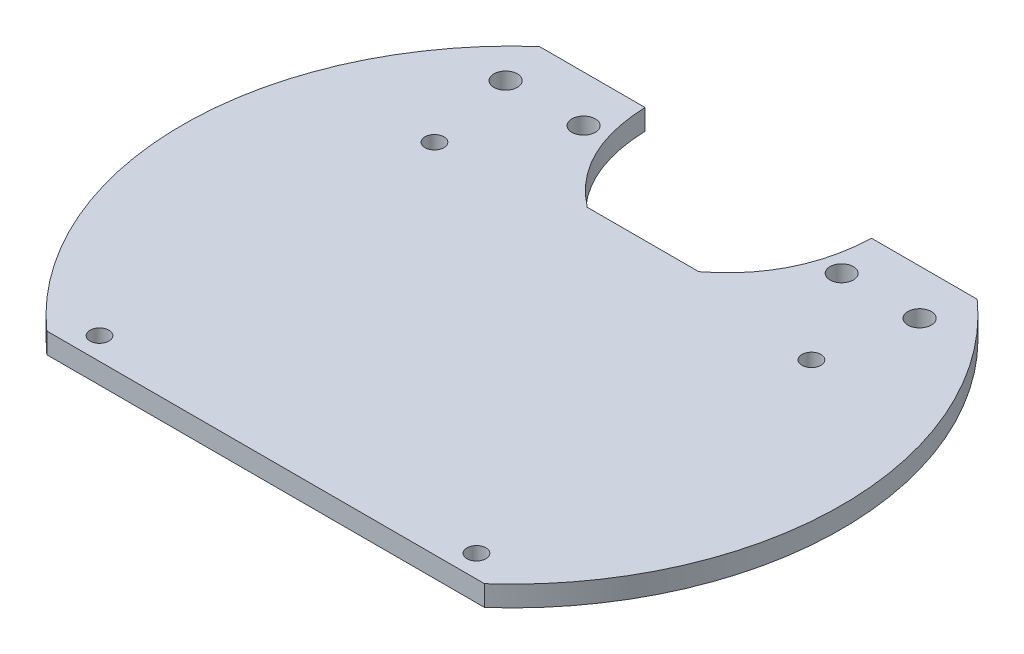
ISO-10303-21;
HEADER;
FILE_DESCRIPTION(('STEP AP214'),'2;1');
FILE_NAME('part.step','',(''),(''),'','','');
FILE_SCHEMA(('AUTOMOTIVE_DESIGN { 1 0 10303 214 1 1 1 1 }'));
ENDSEC;
DATA;
#1=APPLICATION_CONTEXT('core data for automotive mechanical design processes');
#2=APPLICATION_PROTOCOL_DEFINITION('international standard','automotive_design',2000,#1);
#3=PRODUCT_CONTEXT('',#1,'mechanical');
#4=PRODUCT('Part','Part','',(#3));
#5=PRODUCT_RELATED_PRODUCT_CATEGORY('part','',(#4));
#6=PRODUCT_DEFINITION_FORMATION('','',#4);
#7=PRODUCT_DEFINITION_CONTEXT('part definition',#1,'design');
#8=PRODUCT_DEFINITION('design','',#6,#7);
#9=PRODUCT_DEFINITION_SHAPE('','',#8);
#10=(LENGTH_UNIT() NAMED_UNIT(*) SI_UNIT(.MILLI.,.METRE.));
#11=(NAMED_UNIT(*) PLANE_ANGLE_UNIT() SI_UNIT($,.RADIAN.));
#12=(NAMED_UNIT(*) SI_UNIT($,.STERADIAN.) SOLID_ANGLE_UNIT());
#13=UNCERTAINTY_MEASURE_WITH_UNIT(LENGTH_MEASURE(1.E-05),#10,'distance_accuracy_value','');
#14=(GEOMETRIC_REPRESENTATION_CONTEXT(3) GLOBAL_UNCERTAINTY_ASSIGNED_CONTEXT((#13)) GLOBAL_UNIT_ASSIGNED_CONTEXT((#10,
#11,#12)) REPRESENTATION_CONTEXT('',''));
#15=CARTESIAN_POINT('',(0.,0.,0.));
#16=DIRECTION('',(0.,0.,1.));
#17=DIRECTION('',(1.,0.,0.));
#18=AXIS2_PLACEMENT_3D('',#15,#16,#17);
#19=CARTESIAN_POINT('',(0.,3.175,0.));
#20=DIRECTION('',(0.,-1.,0.));
#21=DIRECTION('',(0.,0.,-1.));
#22=AXIS2_PLACEMENT_3D('',#19,#20,#21);
#23=CYLINDRICAL_SURFACE('',#22,50.8);
#24=CARTESIAN_POINT('',(0.,3.175,0.));
#25=DIRECTION('',(0.,1.,0.));
#26=DIRECTION('',(0.,0.,1.));
#27=AXIS2_PLACEMENT_3D('',#24,#25,#26);
#28=CIRCLE('',#27,50.8);
#29=CARTESIAN_POINT('',(33.7387824248831,3.175,37.97808));
#30=VERTEX_POINT('',#29);
#31=CARTESIAN_POINT('',(33.7387824248831,3.175,-37.97808));
#32=VERTEX_POINT('',#31);
#33=EDGE_CURVE('E108',#30,#32,#28,.T.);
#34=ORIENTED_EDGE('',*,*,#33,.F.);
#35=DIRECTION('',(0.,-1.,0.));
#36=VECTOR('',#35,1.);
#37=CARTESIAN_POINT('',(33.7387824248831,3.175,37.97808));
#38=LINE('',#37,#36);
#39=CARTESIAN_POINT('',(33.7387824248831,0.,37.97808));
#40=VERTEX_POINT('',#39);
#41=EDGE_CURVE('E95',#30,#40,#38,.T.);
#42=ORIENTED_EDGE('',*,*,#41,.T.);
#43=CARTESIAN_POINT('',(0.,0.,0.));
#44=DIRECTION('',(0.,1.,0.));
#45=DIRECTION('',(0.,0.,1.));
#46=AXIS2_PLACEMENT_3D('',#43,#44,#45);
#47=CIRCLE('',#46,50.8);
#48=CARTESIAN_POINT('',(33.7387824248831,0.,-37.97808));
#49=VERTEX_POINT('',#48);
#50=EDGE_CURVE('E121',#40,#49,#47,.T.);
#51=ORIENTED_EDGE('',*,*,#50,.T.);
#52=DIRECTION('',(0.,-1.,0.));
#53=VECTOR('',#52,1.);
#54=CARTESIAN_POINT('',(33.7387824248831,3.175,-37.97808));
#55=LINE('',#54,#53);
#56=EDGE_CURVE('E117',#49,#32,#55,.F.);
#57=ORIENTED_EDGE('',*,*,#56,.T.);
#58=EDGE_LOOP('',(#34,#42,#51,#57));
#59=FACE_BOUND('',#58,.T.);
#60=ADVANCED_FACE('F32',(#59),#23,.T.);
#61=CARTESIAN_POINT('',(-33.7387824248831,0.,-37.97808));
#62=VERTEX_POINT('',#61);
#63=CARTESIAN_POINT('',(-33.7387824248831,0.,37.97808));
#64=VERTEX_POINT('',#63);
#65=EDGE_CURVE('E118',#62,#64,#47,.T.);
#66=ORIENTED_EDGE('',*,*,#65,.T.);
#67=DIRECTION('',(0.,-1.,0.));
#68=VECTOR('',#67,1.);
#69=CARTESIAN_POINT('',(-33.7387824248831,3.175,37.97808));
#70=LINE('',#69,#68);
#71=CARTESIAN_POINT('',(-33.7387824248831,3.175,37.97808));
#72=VERTEX_POINT('',#71);
#73=EDGE_CURVE('E47',#64,#72,#70,.F.);
#74=ORIENTED_EDGE('',*,*,#73,.T.);
#75=CARTESIAN_POINT('',(-33.7387824248831,3.175,-37.97808));
#76=VERTEX_POINT('',#75);
#77=EDGE_CURVE('E112',#76,#72,#28,.T.);
#78=ORIENTED_EDGE('',*,*,#77,.F.);
#79=DIRECTION('',(0.,-1.,0.));
#80=VECTOR('',#79,1.);
#81=CARTESIAN_POINT('',(-33.7387824248831,3.175,-37.97808));
#82=LINE('',#81,#80);
#83=EDGE_CURVE('E133',#76,#62,#82,.T.);
#84=ORIENTED_EDGE('',*,*,#83,.T.);
#85=EDGE_LOOP('',(#66,#74,#78,#84));
#86=FACE_BOUND('',#85,.T.);
#87=ADVANCED_FACE('F34',(#86),#23,.T.);
#88=CARTESIAN_POINT('',(0.,3.175,0.));
#89=DIRECTION('',(0.,1.,0.));
#90=DIRECTION('',(0.,0.,1.));
#91=AXIS2_PLACEMENT_3D('',#88,#89,#90);
#92=PLANE('',#91);
#93=CARTESIAN_POINT('',(31.8451131854814,3.175,-30.9939443680849));
#94=DIRECTION('',(0.,-1.,0.));
#95=DIRECTION('',(0.,0.,-1.));
#96=AXIS2_PLACEMENT_3D('',#93,#94,#95);
#97=CIRCLE('',#96,1.81562705856745);
#98=CARTESIAN_POINT('',(31.8451131854814,3.175,-32.8095714266523));
#99=VERTEX_POINT('',#98);
#100=EDGE_CURVE('E243',#99,#99,#97,.T.);
#101=ORIENTED_EDGE('',*,*,#100,.T.);
#102=EDGE_LOOP('',(#101));
#103=FACE_BOUND('',#102,.T.);
#104=CARTESIAN_POINT('',(19.8309131854814,3.175,-30.9939443680849));
#105=DIRECTION('',(0.,-1.,0.));
#106=DIRECTION('',(0.,0.,-1.));
#107=AXIS2_PLACEMENT_3D('',#104,#105,#106);
#108=CIRCLE('',#107,1.79772875448179);
#109=CARTESIAN_POINT('',(19.8309131854814,3.175,-32.7916731225666));
#110=VERTEX_POINT('',#109);
#111=EDGE_CURVE('E237',#110,#110,#108,.T.);
#112=ORIENTED_EDGE('',*,*,#111,.T.);
#113=EDGE_LOOP('',(#112));
#114=FACE_BOUND('',#113,.T.);
#115=CARTESIAN_POINT('',(-19.7853669391257,3.175,-30.8197655228352));
#116=DIRECTION('',(0.,-1.,0.));
#117=DIRECTION('',(0.,0.,-1.));
#118=AXIS2_PLACEMENT_3D('',#115,#116,#117);
#119=CIRCLE('',#118,1.8093290707894);
#120=CARTESIAN_POINT('',(-19.7853669391257,3.175,-32.6290945936246));
#121=VERTEX_POINT('',#120);
#122=EDGE_CURVE('E231',#121,#121,#119,.T.);
#123=ORIENTED_EDGE('',*,*,#122,.T.);
#124=EDGE_LOOP('',(#123));
#125=FACE_BOUND('',#124,.T.);
#126=CARTESIAN_POINT('',(-31.7995669391257,3.175,-30.8197655228352));
#127=DIRECTION('',(0.,-1.,0.));
#128=DIRECTION('',(0.,0.,-1.));
#129=AXIS2_PLACEMENT_3D('',#126,#127,#128);
#130=CIRCLE('',#129,1.81159506012038);
#131=CARTESIAN_POINT('',(-31.7995669391257,3.175,-32.6313605829555));
#132=VERTEX_POINT('',#131);
#133=EDGE_CURVE('E225',#132,#132,#130,.T.);
#134=ORIENTED_EDGE('',*,*,#133,.T.);
#135=EDGE_LOOP('',(#134));
#136=FACE_BOUND('',#135,.T.);
#137=CARTESIAN_POINT('',(-29.0576,3.175,34.5363799999998));
#138=DIRECTION('',(0.,1.,0.));
#139=DIRECTION('',(0.,0.,1.));
#140=AXIS2_PLACEMENT_3D('',#137,#138,#139);
#141=CIRCLE('',#140,1.46050000000051);
#142=CARTESIAN_POINT('',(-29.0576,3.175,35.9968800000004));
#143=VERTEX_POINT('',#142);
#144=EDGE_CURVE('E222',#143,#143,#141,.T.);
#145=ORIENTED_EDGE('',*,*,#144,.F.);
#146=EDGE_LOOP('',(#145));
#147=FACE_BOUND('',#146,.T.);
#148=CARTESIAN_POINT('',(29.0576,3.175,34.5363799999998));
#149=DIRECTION('',(0.,1.,0.));
#150=DIRECTION('',(0.,0.,1.));
#151=AXIS2_PLACEMENT_3D('',#148,#149,#150);
#152=CIRCLE('',#151,1.46050000000058);
#153=CARTESIAN_POINT('',(29.0576,3.175,35.9968800000004));
#154=VERTEX_POINT('',#153);
#155=EDGE_CURVE('E216',#154,#154,#152,.T.);
#156=ORIENTED_EDGE('',*,*,#155,.F.);
#157=EDGE_LOOP('',(#156));
#158=FACE_BOUND('',#157,.T.);
#159=CARTESIAN_POINT('',(29.0576,3.175,-17.1018200000002));
#160=DIRECTION('',(0.,1.,0.));
#161=DIRECTION('',(0.,0.,1.));
#162=AXIS2_PLACEMENT_3D('',#159,#160,#161);
#163=CIRCLE('',#162,1.46050000000037);
#164=CARTESIAN_POINT('',(29.0576,3.175,-15.6413199999998));
#165=VERTEX_POINT('',#164);
#166=EDGE_CURVE('E210',#165,#165,#163,.T.);
#167=ORIENTED_EDGE('',*,*,#166,.F.);
#168=EDGE_LOOP('',(#167));
#169=FACE_BOUND('',#168,.T.);
#170=CARTESIAN_POINT('',(-29.0576,3.175,-17.1018200000002));
#171=DIRECTION('',(0.,1.,0.));
#172=DIRECTION('',(0.,0.,1.));
#173=AXIS2_PLACEMENT_3D('',#170,#171,#172);
#174=CIRCLE('',#173,1.46050000000029);
#175=CARTESIAN_POINT('',(-29.0576,3.175,-15.6413199999999));
#176=VERTEX_POINT('',#175);
#177=EDGE_CURVE('E204',#176,#176,#174,.T.);
#178=ORIENTED_EDGE('',*,*,#177,.F.);
#179=EDGE_LOOP('',(#178));
#180=FACE_BOUND('',#179,.T.);
#181=DIRECTION('',(-1.,0.,0.));
#182=VECTOR('',#181,1.);
#183=CARTESIAN_POINT('',(-53.141111111781,3.175,37.97808));
#184=LINE('',#183,#182);
#185=EDGE_CURVE('E98',#30,#72,#184,.T.);
#186=ORIENTED_EDGE('',*,*,#185,.F.);
#187=ORIENTED_EDGE('',*,*,#33,.T.);
#188=DIRECTION('',(1.,0.,0.));
#189=VECTOR('',#188,1.);
#190=CARTESIAN_POINT('',(17.4664054862569,3.175,-37.97808));
#191=LINE('',#190,#189);
#192=CARTESIAN_POINT('',(17.4664054862569,3.175,-37.97808));
#193=VERTEX_POINT('',#192);
#194=EDGE_CURVE('E145',#193,#32,#191,.T.);
#195=ORIENTED_EDGE('',*,*,#194,.F.);
#196=CARTESIAN_POINT('',(8.59710332212168,3.175,-20.19808));
#197=CARTESIAN_POINT('',(17.0380821659998,3.175,-26.7142867821957));
#198=CARTESIAN_POINT('',(17.4664054862569,3.175,-37.97808));
#199=B_SPLINE_CURVE_WITH_KNOTS('',2,(#196,#197,#198),.UNSPECIFIED.,.F.,.F.,(3,3),(0.,1.),.UNSPECIFIED.);
#200=CARTESIAN_POINT('',(8.59710332212168,3.175,-20.19808));
#201=VERTEX_POINT('',#200);
#202=EDGE_CURVE('E147',#201,#193,#199,.T.);
#203=ORIENTED_EDGE('',*,*,#202,.F.);
#204=DIRECTION('',(1.,0.,0.));
#205=VECTOR('',#204,1.);
#206=CARTESIAN_POINT('',(-8.59710332212168,3.175,-20.19808));
#207=LINE('',#206,#205);
#208=CARTESIAN_POINT('',(-8.59710332212168,3.175,-20.19808));
#209=VERTEX_POINT('',#208);
#210=EDGE_CURVE('E152',#209,#201,#207,.T.);
#211=ORIENTED_EDGE('',*,*,#210,.F.);
#212=CARTESIAN_POINT('',(-17.4664054862569,3.175,-37.97808));
#213=CARTESIAN_POINT('',(-17.0380821659998,3.175,-26.7142867821957));
#214=CARTESIAN_POINT('',(-8.59710332212168,3.175,-20.19808));
#215=B_SPLINE_CURVE_WITH_KNOTS('',2,(#212,#213,#214),.UNSPECIFIED.,.F.,.F.,(3,3),(0.,1.),.UNSPECIFIED.);
#216=CARTESIAN_POINT('',(-17.4664054862569,3.175,-37.97808));
#217=VERTEX_POINT('',#216);
#218=EDGE_CURVE('E158',#217,#209,#215,.T.);
#219=ORIENTED_EDGE('',*,*,#218,.F.);
#220=DIRECTION('',(1.,0.,0.));
#221=VECTOR('',#220,1.);
#222=CARTESIAN_POINT('',(-53.141111111781,3.175,-37.97808));
#223=LINE('',#222,#221);
#224=EDGE_CURVE('E102',#76,#217,#223,.T.);
#225=ORIENTED_EDGE('',*,*,#224,.F.);
#226=ORIENTED_EDGE('',*,*,#77,.T.);
#227=EDGE_LOOP('',(#186,#187,#195,#203,#211,#219,#225,#226));
#228=FACE_BOUND('',#227,.T.);
#229=ADVANCED_FACE('F106',(#103,#114,#125,#136,#147,#158,#169,#180,#228),#92,.T.);
#230=CARTESIAN_POINT('',(0.,0.,0.));
#231=DIRECTION('',(0.,1.,0.));
#232=DIRECTION('',(0.,0.,1.));
#233=AXIS2_PLACEMENT_3D('',#230,#231,#232);
#234=PLANE('',#233);
#235=CARTESIAN_POINT('',(31.8451131854814,0.,-30.9939443680849));
#236=DIRECTION('',(0.,-1.,0.));
#237=DIRECTION('',(0.,0.,-1.));
#238=AXIS2_PLACEMENT_3D('',#235,#236,#237);
#239=CIRCLE('',#238,1.81562705856745);
#240=CARTESIAN_POINT('',(31.8451131854814,0.,-32.8095714266523));
#241=VERTEX_POINT('',#240);
#242=EDGE_CURVE('E246',#241,#241,#239,.T.);
#243=ORIENTED_EDGE('',*,*,#242,.F.);
#244=EDGE_LOOP('',(#243));
#245=FACE_BOUND('',#244,.T.);
#246=CARTESIAN_POINT('',(19.8309131854814,0.,-30.9939443680849));
#247=DIRECTION('',(0.,-1.,0.));
#248=DIRECTION('',(0.,0.,-1.));
#249=AXIS2_PLACEMENT_3D('',#246,#247,#248);
#250=CIRCLE('',#249,1.79772875448179);
#251=CARTESIAN_POINT('',(19.8309131854814,0.,-32.7916731225666));
#252=VERTEX_POINT('',#251);
#253=EDGE_CURVE('E240',#252,#252,#250,.T.);
#254=ORIENTED_EDGE('',*,*,#253,.F.);
#255=EDGE_LOOP('',(#254));
#256=FACE_BOUND('',#255,.T.);
#257=CARTESIAN_POINT('',(-19.7853669391257,0.,-30.8197655228352));
#258=DIRECTION('',(0.,-1.,0.));
#259=DIRECTION('',(0.,0.,-1.));
#260=AXIS2_PLACEMENT_3D('',#257,#258,#259);
#261=CIRCLE('',#260,1.8093290707894);
#262=CARTESIAN_POINT('',(-19.7853669391257,0.,-32.6290945936246));
#263=VERTEX_POINT('',#262);
#264=EDGE_CURVE('E234',#263,#263,#261,.T.);
#265=ORIENTED_EDGE('',*,*,#264,.F.);
#266=EDGE_LOOP('',(#265));
#267=FACE_BOUND('',#266,.T.);
#268=CARTESIAN_POINT('',(-31.7995669391257,0.,-30.8197655228352));
#269=DIRECTION('',(0.,-1.,0.));
#270=DIRECTION('',(0.,0.,-1.));
#271=AXIS2_PLACEMENT_3D('',#268,#269,#270);
#272=CIRCLE('',#271,1.81159506012038);
#273=CARTESIAN_POINT('',(-31.7995669391257,0.,-32.6313605829555));
#274=VERTEX_POINT('',#273);
#275=EDGE_CURVE('E228',#274,#274,#272,.T.);
#276=ORIENTED_EDGE('',*,*,#275,.F.);
#277=EDGE_LOOP('',(#276));
#278=FACE_BOUND('',#277,.T.);
#279=CARTESIAN_POINT('',(-29.0576,0.,34.5363799999998));
#280=DIRECTION('',(0.,1.,0.));
#281=DIRECTION('',(0.,0.,1.));
#282=AXIS2_PLACEMENT_3D('',#279,#280,#281);
#283=CIRCLE('',#282,1.46050000000051);
#284=CARTESIAN_POINT('',(-29.0576,0.,35.9968800000004));
#285=VERTEX_POINT('',#284);
#286=EDGE_CURVE('E219',#285,#285,#283,.T.);
#287=ORIENTED_EDGE('',*,*,#286,.T.);
#288=EDGE_LOOP('',(#287));
#289=FACE_BOUND('',#288,.T.);
#290=CARTESIAN_POINT('',(29.0576,0.,34.5363799999998));
#291=DIRECTION('',(0.,1.,0.));
#292=DIRECTION('',(0.,0.,1.));
#293=AXIS2_PLACEMENT_3D('',#290,#291,#292);
#294=CIRCLE('',#293,1.46050000000058);
#295=CARTESIAN_POINT('',(29.0576,0.,35.9968800000004));
#296=VERTEX_POINT('',#295);
#297=EDGE_CURVE('E213',#296,#296,#294,.T.);
#298=ORIENTED_EDGE('',*,*,#297,.T.);
#299=EDGE_LOOP('',(#298));
#300=FACE_BOUND('',#299,.T.);
#301=CARTESIAN_POINT('',(29.0576,0.,-17.1018200000002));
#302=DIRECTION('',(0.,1.,0.));
#303=DIRECTION('',(0.,0.,1.));
#304=AXIS2_PLACEMENT_3D('',#301,#302,#303);
#305=CIRCLE('',#304,1.46050000000037);
#306=CARTESIAN_POINT('',(29.0576,0.,-15.6413199999998));
#307=VERTEX_POINT('',#306);
#308=EDGE_CURVE('E207',#307,#307,#305,.T.);
#309=ORIENTED_EDGE('',*,*,#308,.T.);
#310=EDGE_LOOP('',(#309));
#311=FACE_BOUND('',#310,.T.);
#312=CARTESIAN_POINT('',(-29.0576,0.,-17.1018200000002));
#313=DIRECTION('',(0.,1.,0.));
#314=DIRECTION('',(0.,0.,1.));
#315=AXIS2_PLACEMENT_3D('',#312,#313,#314);
#316=CIRCLE('',#315,1.46050000000029);
#317=CARTESIAN_POINT('',(-29.0576,0.,-15.6413199999999));
#318=VERTEX_POINT('',#317);
#319=EDGE_CURVE('E113',#318,#318,#316,.T.);
#320=ORIENTED_EDGE('',*,*,#319,.T.);
#321=EDGE_LOOP('',(#320));
#322=FACE_BOUND('',#321,.T.);
#323=ORIENTED_EDGE('',*,*,#50,.F.);
#324=DIRECTION('',(-1.,0.,0.));
#325=VECTOR('',#324,1.);
#326=CARTESIAN_POINT('',(0.,0.,37.97808));
#327=LINE('',#326,#325);
#328=EDGE_CURVE('E11',#40,#64,#327,.T.);
#329=ORIENTED_EDGE('',*,*,#328,.T.);
#330=ORIENTED_EDGE('',*,*,#65,.F.);
#331=DIRECTION('',(1.,0.,0.));
#332=VECTOR('',#331,1.);
#333=CARTESIAN_POINT('',(0.,0.,-37.97808));
#334=LINE('',#333,#332);
#335=CARTESIAN_POINT('',(-17.4664054862569,0.,-37.97808));
#336=VERTEX_POINT('',#335);
#337=EDGE_CURVE('E40',#62,#336,#334,.T.);
#338=ORIENTED_EDGE('',*,*,#337,.T.);
#339=CARTESIAN_POINT('',(-17.4664054862569,0.,-37.97808));
#340=CARTESIAN_POINT('',(-17.0380821659998,0.,-26.7142867821957));
#341=CARTESIAN_POINT('',(-8.59710332212168,0.,-20.19808));
#342=B_SPLINE_CURVE_WITH_KNOTS('',2,(#339,#340,#341),.UNSPECIFIED.,.F.,.F.,(3,3),(0.,1.),.UNSPECIFIED.);
#343=CARTESIAN_POINT('',(-8.59710332212168,0.,-20.19808));
#344=VERTEX_POINT('',#343);
#345=EDGE_CURVE('E54',#336,#344,#342,.T.);
#346=ORIENTED_EDGE('',*,*,#345,.T.);
#347=DIRECTION('',(1.,0.,0.));
#348=VECTOR('',#347,1.);
#349=CARTESIAN_POINT('',(-8.59710332212168,0.,-20.19808));
#350=LINE('',#349,#348);
#351=CARTESIAN_POINT('',(8.59710332212168,0.,-20.19808));
#352=VERTEX_POINT('',#351);
#353=EDGE_CURVE('E175',#344,#352,#350,.T.);
#354=ORIENTED_EDGE('',*,*,#353,.T.);
#355=CARTESIAN_POINT('',(8.59710332212168,0.,-20.19808));
#356=CARTESIAN_POINT('',(17.0380821659998,0.,-26.7142867821957));
#357=CARTESIAN_POINT('',(17.4664054862569,0.,-37.97808));
#358=B_SPLINE_CURVE_WITH_KNOTS('',2,(#355,#356,#357),.UNSPECIFIED.,.F.,.F.,(3,3),(0.,1.),.UNSPECIFIED.);
#359=CARTESIAN_POINT('',(17.4664054862569,0.,-37.97808));
#360=VERTEX_POINT('',#359);
#361=EDGE_CURVE('E169',#352,#360,#358,.T.);
#362=ORIENTED_EDGE('',*,*,#361,.T.);
#363=DIRECTION('',(1.,0.,0.));
#364=VECTOR('',#363,1.);
#365=CARTESIAN_POINT('',(17.4664054862569,0.,-37.97808));
#366=LINE('',#365,#364);
#367=EDGE_CURVE('E142',#360,#49,#366,.T.);
#368=ORIENTED_EDGE('',*,*,#367,.T.);
#369=EDGE_LOOP('',(#323,#329,#330,#338,#346,#354,#362,#368));
#370=FACE_BOUND('',#369,.T.);
#371=ADVANCED_FACE('F128',(#245,#256,#267,#278,#289,#300,#311,#322,#370),#234,.F.);
#372=CARTESIAN_POINT('',(17.4664054862569,0.,-37.97808));
#373=DIRECTION('',(0.,0.,1.));
#374=DIRECTION('',(1.,0.,0.));
#375=AXIS2_PLACEMENT_3D('',#372,#373,#374);
#376=PLANE('',#375);
#377=ORIENTED_EDGE('',*,*,#367,.F.);
#378=DIRECTION('',(0.,1.,0.));
#379=VECTOR('',#378,1.);
#380=CARTESIAN_POINT('',(17.4664054862569,0.,-37.97808));
#381=LINE('',#380,#379);
#382=EDGE_CURVE('E136',#360,#193,#381,.T.);
#383=ORIENTED_EDGE('',*,*,#382,.T.);
#384=ORIENTED_EDGE('',*,*,#194,.T.);
#385=ORIENTED_EDGE('',*,*,#56,.F.);
#386=EDGE_LOOP('',(#377,#383,#384,#385));
#387=FACE_BOUND('',#386,.T.);
#388=ADVANCED_FACE('F187',(#387),#376,.F.);
#389=CARTESIAN_POINT('',(-53.141111111781,0.,-37.97808));
#390=DIRECTION('',(0.,0.,1.));
#391=DIRECTION('',(1.,0.,0.));
#392=AXIS2_PLACEMENT_3D('',#389,#390,#391);
#393=PLANE('',#392);
#394=ORIENTED_EDGE('',*,*,#224,.T.);
#395=DIRECTION('',(0.,1.,0.));
#396=VECTOR('',#395,1.);
#397=CARTESIAN_POINT('',(-17.4664054862569,0.,-37.97808));
#398=LINE('',#397,#396);
#399=EDGE_CURVE('E134',#336,#217,#398,.T.);
#400=ORIENTED_EDGE('',*,*,#399,.F.);
#401=ORIENTED_EDGE('',*,*,#337,.F.);
#402=ORIENTED_EDGE('',*,*,#83,.F.);
#403=EDGE_LOOP('',(#394,#400,#401,#402));
#404=FACE_BOUND('',#403,.T.);
#405=ADVANCED_FACE('F132',(#404),#393,.F.);
#406=DIRECTION('',(0.,1.,0.));
#407=VECTOR('',#406,1.);
#408=SURFACE_OF_LINEAR_EXTRUSION('',#358,#407);
#409=ORIENTED_EDGE('',*,*,#202,.T.);
#410=ORIENTED_EDGE('',*,*,#382,.F.);
#411=ORIENTED_EDGE('',*,*,#361,.F.);
#412=DIRECTION('',(0.,1.,0.));
#413=VECTOR('',#412,1.);
#414=CARTESIAN_POINT('',(8.59710332212168,0.,-20.19808));
#415=LINE('',#414,#413);
#416=EDGE_CURVE('E137',#352,#201,#415,.T.);
#417=ORIENTED_EDGE('',*,*,#416,.T.);
#418=EDGE_LOOP('',(#409,#410,#411,#417));
#419=FACE_BOUND('',#418,.T.);
#420=ADVANCED_FACE('F181',(#419),#408,.F.);
#421=CARTESIAN_POINT('',(-8.59710332212168,0.,-20.19808));
#422=DIRECTION('',(0.,0.,1.));
#423=DIRECTION('',(1.,0.,0.));
#424=AXIS2_PLACEMENT_3D('',#421,#422,#423);
#425=PLANE('',#424);
#426=ORIENTED_EDGE('',*,*,#210,.T.);
#427=ORIENTED_EDGE('',*,*,#416,.F.);
#428=ORIENTED_EDGE('',*,*,#353,.F.);
#429=DIRECTION('',(0.,1.,0.));
#430=VECTOR('',#429,1.);
#431=CARTESIAN_POINT('',(-8.59710332212168,0.,-20.19808));
#432=LINE('',#431,#430);
#433=EDGE_CURVE('E141',#344,#209,#432,.T.);
#434=ORIENTED_EDGE('',*,*,#433,.T.);
#435=EDGE_LOOP('',(#426,#427,#428,#434));
#436=FACE_BOUND('',#435,.T.);
#437=ADVANCED_FACE('F185',(#436),#425,.F.);
#438=DIRECTION('',(0.,1.,0.));
#439=VECTOR('',#438,1.);
#440=SURFACE_OF_LINEAR_EXTRUSION('',#342,#439);
#441=ORIENTED_EDGE('',*,*,#218,.T.);
#442=ORIENTED_EDGE('',*,*,#433,.F.);
#443=ORIENTED_EDGE('',*,*,#345,.F.);
#444=ORIENTED_EDGE('',*,*,#399,.T.);
#445=EDGE_LOOP('',(#441,#442,#443,#444));
#446=FACE_BOUND('',#445,.T.);
#447=ADVANCED_FACE('F191',(#446),#440,.F.);
#448=CARTESIAN_POINT('',(-53.141111111781,0.,37.97808));
#449=DIRECTION('',(0.,0.,-1.));
#450=DIRECTION('',(-1.,0.,0.));
#451=AXIS2_PLACEMENT_3D('',#448,#449,#450);
#452=PLANE('',#451);
#453=ORIENTED_EDGE('',*,*,#185,.T.);
#454=ORIENTED_EDGE('',*,*,#73,.F.);
#455=ORIENTED_EDGE('',*,*,#328,.F.);
#456=ORIENTED_EDGE('',*,*,#41,.F.);
#457=EDGE_LOOP('',(#453,#454,#455,#456));
#458=FACE_BOUND('',#457,.T.);
#459=ADVANCED_FACE('F97',(#458),#452,.F.);
#460=CARTESIAN_POINT('',(-29.0576,0.,-17.1018200000002));
#461=DIRECTION('',(0.,1.,0.));
#462=DIRECTION('',(0.,0.,1.));
#463=AXIS2_PLACEMENT_3D('',#460,#461,#462);
#464=CYLINDRICAL_SURFACE('',#463,1.46050000000029);
#465=ORIENTED_EDGE('',*,*,#319,.F.);
#466=EDGE_LOOP('',(#465));
#467=FACE_BOUND('',#466,.T.);
#468=ORIENTED_EDGE('',*,*,#177,.T.);
#469=EDGE_LOOP('',(#468));
#470=FACE_BOUND('',#469,.T.);
#471=ADVANCED_FACE('F277',(#467,#470),#464,.F.);
#472=CARTESIAN_POINT('',(29.0576,0.,-17.1018200000002));
#473=DIRECTION('',(0.,1.,0.));
#474=DIRECTION('',(0.,0.,1.));
#475=AXIS2_PLACEMENT_3D('',#472,#473,#474);
#476=CYLINDRICAL_SURFACE('',#475,1.46050000000037);
#477=ORIENTED_EDGE('',*,*,#308,.F.);
#478=EDGE_LOOP('',(#477));
#479=FACE_BOUND('',#478,.T.);
#480=ORIENTED_EDGE('',*,*,#166,.T.);
#481=EDGE_LOOP('',(#480));
#482=FACE_BOUND('',#481,.T.);
#483=ADVANCED_FACE('F280',(#479,#482),#476,.F.);
#484=CARTESIAN_POINT('',(29.0576,0.,34.5363799999998));
#485=DIRECTION('',(0.,1.,0.));
#486=DIRECTION('',(0.,0.,1.));
#487=AXIS2_PLACEMENT_3D('',#484,#485,#486);
#488=CYLINDRICAL_SURFACE('',#487,1.46050000000058);
#489=ORIENTED_EDGE('',*,*,#297,.F.);
#490=EDGE_LOOP('',(#489));
#491=FACE_BOUND('',#490,.T.);
#492=ORIENTED_EDGE('',*,*,#155,.T.);
#493=EDGE_LOOP('',(#492));
#494=FACE_BOUND('',#493,.T.);
#495=ADVANCED_FACE('F345',(#491,#494),#488,.F.);
#496=CARTESIAN_POINT('',(-29.0576,0.,34.5363799999998));
#497=DIRECTION('',(0.,1.,0.));
#498=DIRECTION('',(0.,0.,1.));
#499=AXIS2_PLACEMENT_3D('',#496,#497,#498);
#500=CYLINDRICAL_SURFACE('',#499,1.46050000000051);
#501=ORIENTED_EDGE('',*,*,#286,.F.);
#502=EDGE_LOOP('',(#501));
#503=FACE_BOUND('',#502,.T.);
#504=ORIENTED_EDGE('',*,*,#144,.T.);
#505=EDGE_LOOP('',(#504));
#506=FACE_BOUND('',#505,.T.);
#507=ADVANCED_FACE('F353',(#503,#506),#500,.F.);
#508=CARTESIAN_POINT('',(-31.7995669391257,3.175,-30.8197655228352));
#509=DIRECTION('',(0.,-1.,0.));
#510=DIRECTION('',(0.,0.,-1.));
#511=AXIS2_PLACEMENT_3D('',#508,#509,#510);
#512=CYLINDRICAL_SURFACE('',#511,1.81159506012038);
#513=ORIENTED_EDGE('',*,*,#133,.F.);
#514=EDGE_LOOP('',(#513));
#515=FACE_BOUND('',#514,.T.);
#516=ORIENTED_EDGE('',*,*,#275,.T.);
#517=EDGE_LOOP('',(#516));
#518=FACE_BOUND('',#517,.T.);
#519=ADVANCED_FACE('F360',(#515,#518),#512,.F.);
#520=CARTESIAN_POINT('',(-19.7853669391257,3.175,-30.8197655228352));
#521=DIRECTION('',(0.,-1.,0.));
#522=DIRECTION('',(0.,0.,-1.));
#523=AXIS2_PLACEMENT_3D('',#520,#521,#522);
#524=CYLINDRICAL_SURFACE('',#523,1.8093290707894);
#525=ORIENTED_EDGE('',*,*,#122,.F.);
#526=EDGE_LOOP('',(#525));
#527=FACE_BOUND('',#526,.T.);
#528=ORIENTED_EDGE('',*,*,#264,.T.);
#529=EDGE_LOOP('',(#528));
#530=FACE_BOUND('',#529,.T.);
#531=ADVANCED_FACE('F367',(#527,#530),#524,.F.);
#532=CARTESIAN_POINT('',(19.8309131854814,3.175,-30.9939443680849));
#533=DIRECTION('',(0.,-1.,0.));
#534=DIRECTION('',(0.,0.,-1.));
#535=AXIS2_PLACEMENT_3D('',#532,#533,#534);
#536=CYLINDRICAL_SURFACE('',#535,1.79772875448179);
#537=ORIENTED_EDGE('',*,*,#111,.F.);
#538=EDGE_LOOP('',(#537));
#539=FACE_BOUND('',#538,.T.);
#540=ORIENTED_EDGE('',*,*,#253,.T.);
#541=EDGE_LOOP('',(#540));
#542=FACE_BOUND('',#541,.T.);
#543=ADVANCED_FACE('F257',(#539,#542),#536,.F.);
#544=CARTESIAN_POINT('',(31.8451131854814,3.175,-30.9939443680849));
#545=DIRECTION('',(0.,-1.,0.));
#546=DIRECTION('',(0.,0.,-1.));
#547=AXIS2_PLACEMENT_3D('',#544,#545,#546);
#548=CYLINDRICAL_SURFACE('',#547,1.81562705856745);
#549=ORIENTED_EDGE('',*,*,#100,.F.);
#550=EDGE_LOOP('',(#549));
#551=FACE_BOUND('',#550,.T.);
#552=ORIENTED_EDGE('',*,*,#242,.T.);
#553=EDGE_LOOP('',(#552));
#554=FACE_BOUND('',#553,.T.);
#555=ADVANCED_FACE('F254',(#551,#554),#548,.F.);
#556=CLOSED_SHELL('',(#60,#87,#229,#371,#388,#405,#420,#437,#447,#459,#471,#483,#495,#507,#519,
#531,#543,#555));
#557=MANIFOLD_SOLID_BREP('B2',#556);
#558=ADVANCED_BREP_SHAPE_REPRESENTATION('',(#18,#557),#14);
#559=SHAPE_DEFINITION_REPRESENTATION(#9,#558);
ENDSEC;
END-ISO-10303-21;
